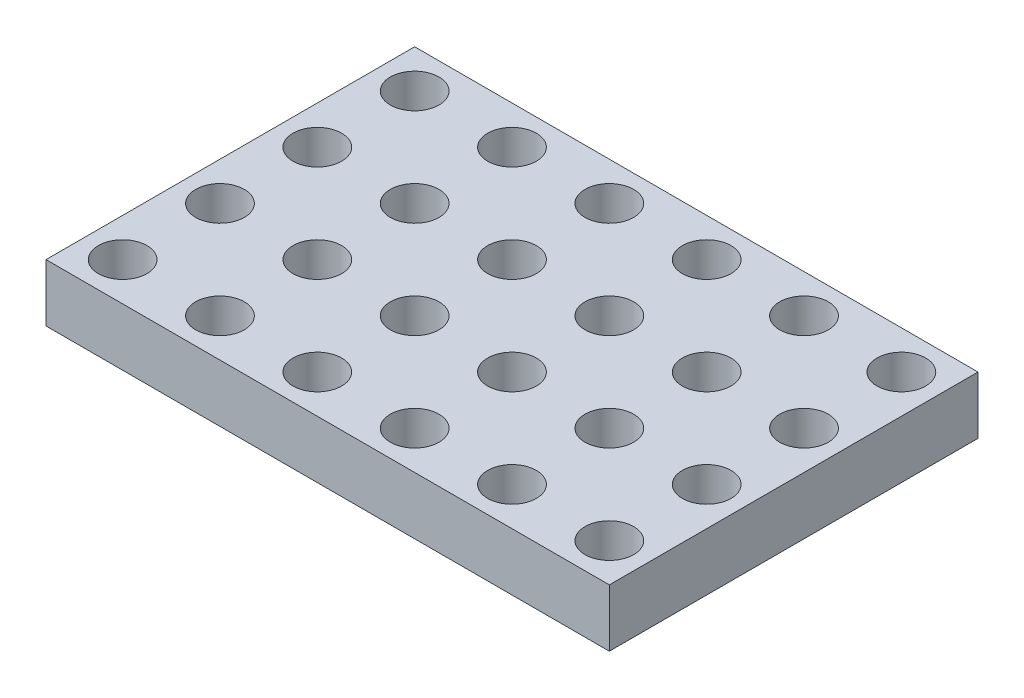
ISO-10303-21;
HEADER;
FILE_DESCRIPTION(('STEP AP214'),'2;1');
FILE_NAME('part.step','',(''),(''),'','','');
FILE_SCHEMA(('AUTOMOTIVE_DESIGN { 1 0 10303 214 1 1 1 1 }'));
ENDSEC;
DATA;
#1=APPLICATION_CONTEXT('core data for automotive mechanical design processes');
#2=APPLICATION_PROTOCOL_DEFINITION('international standard','automotive_design',2000,#1);
#3=PRODUCT_CONTEXT('',#1,'mechanical');
#4=PRODUCT('Part','Part','',(#3));
#5=PRODUCT_RELATED_PRODUCT_CATEGORY('part','',(#4));
#6=PRODUCT_DEFINITION_FORMATION('','',#4);
#7=PRODUCT_DEFINITION_CONTEXT('part definition',#1,'design');
#8=PRODUCT_DEFINITION('design','',#6,#7);
#9=PRODUCT_DEFINITION_SHAPE('','',#8);
#10=(LENGTH_UNIT() NAMED_UNIT(*) SI_UNIT(.MILLI.,.METRE.));
#11=(NAMED_UNIT(*) PLANE_ANGLE_UNIT() SI_UNIT($,.RADIAN.));
#12=(NAMED_UNIT(*) SI_UNIT($,.STERADIAN.) SOLID_ANGLE_UNIT());
#13=UNCERTAINTY_MEASURE_WITH_UNIT(LENGTH_MEASURE(1.E-05),#10,'distance_accuracy_value','');
#14=(GEOMETRIC_REPRESENTATION_CONTEXT(3) GLOBAL_UNCERTAINTY_ASSIGNED_CONTEXT((#13)) GLOBAL_UNIT_ASSIGNED_CONTEXT((#10,
#11,#12)) REPRESENTATION_CONTEXT('',''));
#15=CARTESIAN_POINT('',(0.,0.,0.));
#16=DIRECTION('',(0.,0.,1.));
#17=DIRECTION('',(1.,0.,0.));
#18=AXIS2_PLACEMENT_3D('',#15,#16,#17);
#19=CARTESIAN_POINT('',(0.,1.5,0.));
#20=DIRECTION('',(0.,1.,0.));
#21=DIRECTION('',(0.,0.,1.));
#22=AXIS2_PLACEMENT_3D('',#19,#20,#21);
#23=PLANE('',#22);
#24=CARTESIAN_POINT('',(3.81000000000008,1.5,3.81));
#25=DIRECTION('',(0.,1.,0.));
#26=DIRECTION('',(0.,0.,1.));
#27=AXIS2_PLACEMENT_3D('',#24,#25,#26);
#28=CIRCLE('',#27,0.635000000000001);
#29=CARTESIAN_POINT('',(3.81000000000008,1.5,4.445));
#30=VERTEX_POINT('',#29);
#31=EDGE_CURVE('E241',#30,#30,#28,.T.);
#32=ORIENTED_EDGE('',*,*,#31,.F.);
#33=EDGE_LOOP('',(#32));
#34=FACE_BOUND('',#33,.T.);
#35=CARTESIAN_POINT('',(-1.26999999999992,1.5,3.81));
#36=DIRECTION('',(0.,1.,0.));
#37=DIRECTION('',(0.,0.,1.));
#38=AXIS2_PLACEMENT_3D('',#35,#36,#37);
#39=CIRCLE('',#38,0.635);
#40=CARTESIAN_POINT('',(-1.26999999999992,1.5,4.445));
#41=VERTEX_POINT('',#40);
#42=EDGE_CURVE('E229',#41,#41,#39,.T.);
#43=ORIENTED_EDGE('',*,*,#42,.F.);
#44=EDGE_LOOP('',(#43));
#45=FACE_BOUND('',#44,.T.);
#46=CARTESIAN_POINT('',(-6.34999999999992,1.5,3.81));
#47=DIRECTION('',(0.,1.,0.));
#48=DIRECTION('',(0.,0.,1.));
#49=AXIS2_PLACEMENT_3D('',#46,#47,#48);
#50=CIRCLE('',#49,0.635000000000001);
#51=CARTESIAN_POINT('',(-6.34999999999992,1.5,4.445));
#52=VERTEX_POINT('',#51);
#53=EDGE_CURVE('E217',#52,#52,#50,.T.);
#54=ORIENTED_EDGE('',*,*,#53,.F.);
#55=EDGE_LOOP('',(#54));
#56=FACE_BOUND('',#55,.T.);
#57=CARTESIAN_POINT('',(3.81000000000005,1.5,1.27));
#58=DIRECTION('',(0.,1.,0.));
#59=DIRECTION('',(0.,0.,1.));
#60=AXIS2_PLACEMENT_3D('',#57,#58,#59);
#61=CIRCLE('',#60,0.635000000000001);
#62=CARTESIAN_POINT('',(3.81000000000005,1.5,1.905));
#63=VERTEX_POINT('',#62);
#64=EDGE_CURVE('E205',#63,#63,#61,.T.);
#65=ORIENTED_EDGE('',*,*,#64,.F.);
#66=EDGE_LOOP('',(#65));
#67=FACE_BOUND('',#66,.T.);
#68=CARTESIAN_POINT('',(-1.26999999999995,1.5,1.27));
#69=DIRECTION('',(0.,1.,0.));
#70=DIRECTION('',(0.,0.,1.));
#71=AXIS2_PLACEMENT_3D('',#68,#69,#70);
#72=CIRCLE('',#71,0.635);
#73=CARTESIAN_POINT('',(-1.26999999999995,1.5,1.905));
#74=VERTEX_POINT('',#73);
#75=EDGE_CURVE('E193',#74,#74,#72,.T.);
#76=ORIENTED_EDGE('',*,*,#75,.F.);
#77=EDGE_LOOP('',(#76));
#78=FACE_BOUND('',#77,.T.);
#79=CARTESIAN_POINT('',(-6.34999999999995,1.5,1.27));
#80=DIRECTION('',(0.,1.,0.));
#81=DIRECTION('',(0.,0.,1.));
#82=AXIS2_PLACEMENT_3D('',#79,#80,#81);
#83=CIRCLE('',#82,0.635);
#84=CARTESIAN_POINT('',(-6.34999999999995,1.5,1.905));
#85=VERTEX_POINT('',#84);
#86=EDGE_CURVE('E181',#85,#85,#83,.T.);
#87=ORIENTED_EDGE('',*,*,#86,.F.);
#88=EDGE_LOOP('',(#87));
#89=FACE_BOUND('',#88,.T.);
#90=CARTESIAN_POINT('',(3.81000000000003,1.5,-1.27));
#91=DIRECTION('',(0.,1.,0.));
#92=DIRECTION('',(0.,0.,1.));
#93=AXIS2_PLACEMENT_3D('',#90,#91,#92);
#94=CIRCLE('',#93,0.635000000000001);
#95=CARTESIAN_POINT('',(3.81000000000003,1.5,-0.634999999999996));
#96=VERTEX_POINT('',#95);
#97=EDGE_CURVE('E169',#96,#96,#94,.T.);
#98=ORIENTED_EDGE('',*,*,#97,.F.);
#99=EDGE_LOOP('',(#98));
#100=FACE_BOUND('',#99,.T.);
#101=CARTESIAN_POINT('',(-1.26999999999997,1.5,-1.27));
#102=DIRECTION('',(0.,1.,0.));
#103=DIRECTION('',(0.,0.,1.));
#104=AXIS2_PLACEMENT_3D('',#101,#102,#103);
#105=CIRCLE('',#104,0.635);
#106=CARTESIAN_POINT('',(-1.26999999999997,1.5,-0.634999999999996));
#107=VERTEX_POINT('',#106);
#108=EDGE_CURVE('E157',#107,#107,#105,.T.);
#109=ORIENTED_EDGE('',*,*,#108,.F.);
#110=EDGE_LOOP('',(#109));
#111=FACE_BOUND('',#110,.T.);
#112=CARTESIAN_POINT('',(-6.34999999999997,1.5,-1.27));
#113=DIRECTION('',(0.,1.,0.));
#114=DIRECTION('',(0.,0.,1.));
#115=AXIS2_PLACEMENT_3D('',#112,#113,#114);
#116=CIRCLE('',#115,0.635);
#117=CARTESIAN_POINT('',(-6.34999999999997,1.5,-0.634999999999997));
#118=VERTEX_POINT('',#117);
#119=EDGE_CURVE('E145',#118,#118,#116,.T.);
#120=ORIENTED_EDGE('',*,*,#119,.F.);
#121=EDGE_LOOP('',(#120));
#122=FACE_BOUND('',#121,.T.);
#123=CARTESIAN_POINT('',(3.81,1.5,-3.81));
#124=DIRECTION('',(0.,1.,0.));
#125=DIRECTION('',(0.,0.,1.));
#126=AXIS2_PLACEMENT_3D('',#123,#124,#125);
#127=CIRCLE('',#126,0.635000000000001);
#128=CARTESIAN_POINT('',(3.81,1.5,-3.175));
#129=VERTEX_POINT('',#128);
#130=EDGE_CURVE('E133',#129,#129,#127,.T.);
#131=ORIENTED_EDGE('',*,*,#130,.F.);
#132=EDGE_LOOP('',(#131));
#133=FACE_BOUND('',#132,.T.);
#134=CARTESIAN_POINT('',(-1.27,1.5,-3.81));
#135=DIRECTION('',(0.,1.,0.));
#136=DIRECTION('',(0.,0.,1.));
#137=AXIS2_PLACEMENT_3D('',#134,#135,#136);
#138=CIRCLE('',#137,0.635);
#139=CARTESIAN_POINT('',(-1.27,1.5,-3.175));
#140=VERTEX_POINT('',#139);
#141=EDGE_CURVE('E121',#140,#140,#138,.T.);
#142=ORIENTED_EDGE('',*,*,#141,.F.);
#143=EDGE_LOOP('',(#142));
#144=FACE_BOUND('',#143,.T.);
#145=CARTESIAN_POINT('',(-6.35,1.5,-3.81));
#146=DIRECTION('',(0.,1.,0.));
#147=DIRECTION('',(0.,0.,1.));
#148=AXIS2_PLACEMENT_3D('',#145,#146,#147);
#149=CIRCLE('',#148,0.635000000000001);
#150=CARTESIAN_POINT('',(-6.35,1.5,-3.175));
#151=VERTEX_POINT('',#150);
#152=EDGE_CURVE('E100',#151,#151,#149,.T.);
#153=ORIENTED_EDGE('',*,*,#152,.F.);
#154=EDGE_LOOP('',(#153));
#155=FACE_BOUND('',#154,.T.);
#156=DIRECTION('',(0.,0.,1.));
#157=VECTOR('',#156,1.);
#158=CARTESIAN_POINT('',(-7.35,1.5,4.81));
#159=LINE('',#158,#157);
#160=CARTESIAN_POINT('',(-7.35,1.5,-4.81));
#161=VERTEX_POINT('',#160);
#162=CARTESIAN_POINT('',(-7.35,1.5,4.81));
#163=VERTEX_POINT('',#162);
#164=EDGE_CURVE('E85',#161,#163,#159,.T.);
#165=ORIENTED_EDGE('',*,*,#164,.T.);
#166=DIRECTION('',(1.,0.,0.));
#167=VECTOR('',#166,1.);
#168=CARTESIAN_POINT('',(7.35,1.5,4.81));
#169=LINE('',#168,#167);
#170=CARTESIAN_POINT('',(7.35,1.5,4.81));
#171=VERTEX_POINT('',#170);
#172=EDGE_CURVE('E80',#163,#171,#169,.T.);
#173=ORIENTED_EDGE('',*,*,#172,.T.);
#174=DIRECTION('',(0.,0.,-1.));
#175=VECTOR('',#174,1.);
#176=CARTESIAN_POINT('',(7.35,1.5,4.81));
#177=LINE('',#176,#175);
#178=CARTESIAN_POINT('',(7.35,1.5,-4.81));
#179=VERTEX_POINT('',#178);
#180=EDGE_CURVE('E83',#171,#179,#177,.T.);
#181=ORIENTED_EDGE('',*,*,#180,.T.);
#182=DIRECTION('',(-1.,0.,0.));
#183=VECTOR('',#182,1.);
#184=CARTESIAN_POINT('',(7.35,1.5,-4.81));
#185=LINE('',#184,#183);
#186=EDGE_CURVE('E50',#179,#161,#185,.T.);
#187=ORIENTED_EDGE('',*,*,#186,.T.);
#188=EDGE_LOOP('',(#165,#173,#181,#187));
#189=FACE_BOUND('',#188,.T.);
#190=CARTESIAN_POINT('',(-3.81,1.5,-3.81));
#191=DIRECTION('',(0.,1.,0.));
#192=DIRECTION('',(0.,0.,1.));
#193=AXIS2_PLACEMENT_3D('',#190,#191,#192);
#194=CIRCLE('',#193,0.635);
#195=CARTESIAN_POINT('',(-3.81,1.5,-3.175));
#196=VERTEX_POINT('',#195);
#197=EDGE_CURVE('E115',#196,#196,#194,.T.);
#198=ORIENTED_EDGE('',*,*,#197,.F.);
#199=EDGE_LOOP('',(#198));
#200=FACE_BOUND('',#199,.T.);
#201=CARTESIAN_POINT('',(1.27,1.5,-3.81));
#202=DIRECTION('',(0.,1.,0.));
#203=DIRECTION('',(0.,0.,1.));
#204=AXIS2_PLACEMENT_3D('',#201,#202,#203);
#205=CIRCLE('',#204,0.635);
#206=CARTESIAN_POINT('',(1.27,1.5,-3.175));
#207=VERTEX_POINT('',#206);
#208=EDGE_CURVE('E127',#207,#207,#205,.T.);
#209=ORIENTED_EDGE('',*,*,#208,.F.);
#210=EDGE_LOOP('',(#209));
#211=FACE_BOUND('',#210,.T.);
#212=CARTESIAN_POINT('',(6.35,1.5,-3.81));
#213=DIRECTION('',(0.,1.,0.));
#214=DIRECTION('',(0.,0.,1.));
#215=AXIS2_PLACEMENT_3D('',#212,#213,#214);
#216=CIRCLE('',#215,0.635000000000001);
#217=CARTESIAN_POINT('',(6.35,1.5,-3.175));
#218=VERTEX_POINT('',#217);
#219=EDGE_CURVE('E139',#218,#218,#216,.T.);
#220=ORIENTED_EDGE('',*,*,#219,.F.);
#221=EDGE_LOOP('',(#220));
#222=FACE_BOUND('',#221,.T.);
#223=CARTESIAN_POINT('',(-3.80999999999997,1.5,-1.27));
#224=DIRECTION('',(0.,1.,0.));
#225=DIRECTION('',(0.,0.,1.));
#226=AXIS2_PLACEMENT_3D('',#223,#224,#225);
#227=CIRCLE('',#226,0.635);
#228=CARTESIAN_POINT('',(-3.80999999999997,1.5,-0.634999999999996));
#229=VERTEX_POINT('',#228);
#230=EDGE_CURVE('E151',#229,#229,#227,.T.);
#231=ORIENTED_EDGE('',*,*,#230,.F.);
#232=EDGE_LOOP('',(#231));
#233=FACE_BOUND('',#232,.T.);
#234=CARTESIAN_POINT('',(1.27000000000003,1.5,-1.27));
#235=DIRECTION('',(0.,1.,0.));
#236=DIRECTION('',(0.,0.,1.));
#237=AXIS2_PLACEMENT_3D('',#234,#235,#236);
#238=CIRCLE('',#237,0.635);
#239=CARTESIAN_POINT('',(1.27000000000003,1.5,-0.634999999999996));
#240=VERTEX_POINT('',#239);
#241=EDGE_CURVE('E163',#240,#240,#238,.T.);
#242=ORIENTED_EDGE('',*,*,#241,.F.);
#243=EDGE_LOOP('',(#242));
#244=FACE_BOUND('',#243,.T.);
#245=CARTESIAN_POINT('',(6.35000000000003,1.5,-1.27));
#246=DIRECTION('',(0.,1.,0.));
#247=DIRECTION('',(0.,0.,1.));
#248=AXIS2_PLACEMENT_3D('',#245,#246,#247);
#249=CIRCLE('',#248,0.635000000000001);
#250=CARTESIAN_POINT('',(6.35000000000003,1.5,-0.634999999999996));
#251=VERTEX_POINT('',#250);
#252=EDGE_CURVE('E175',#251,#251,#249,.T.);
#253=ORIENTED_EDGE('',*,*,#252,.F.);
#254=EDGE_LOOP('',(#253));
#255=FACE_BOUND('',#254,.T.);
#256=CARTESIAN_POINT('',(-3.80999999999995,1.5,1.27));
#257=DIRECTION('',(0.,1.,0.));
#258=DIRECTION('',(0.,0.,1.));
#259=AXIS2_PLACEMENT_3D('',#256,#257,#258);
#260=CIRCLE('',#259,0.635);
#261=CARTESIAN_POINT('',(-3.80999999999995,1.5,1.905));
#262=VERTEX_POINT('',#261);
#263=EDGE_CURVE('E187',#262,#262,#260,.T.);
#264=ORIENTED_EDGE('',*,*,#263,.F.);
#265=EDGE_LOOP('',(#264));
#266=FACE_BOUND('',#265,.T.);
#267=CARTESIAN_POINT('',(1.27000000000005,1.5,1.27));
#268=DIRECTION('',(0.,1.,0.));
#269=DIRECTION('',(0.,0.,1.));
#270=AXIS2_PLACEMENT_3D('',#267,#268,#269);
#271=CIRCLE('',#270,0.635);
#272=CARTESIAN_POINT('',(1.27000000000005,1.5,1.905));
#273=VERTEX_POINT('',#272);
#274=EDGE_CURVE('E199',#273,#273,#271,.T.);
#275=ORIENTED_EDGE('',*,*,#274,.F.);
#276=EDGE_LOOP('',(#275));
#277=FACE_BOUND('',#276,.T.);
#278=CARTESIAN_POINT('',(6.35000000000006,1.5,1.27));
#279=DIRECTION('',(0.,1.,0.));
#280=DIRECTION('',(0.,0.,1.));
#281=AXIS2_PLACEMENT_3D('',#278,#279,#280);
#282=CIRCLE('',#281,0.635000000000001);
#283=CARTESIAN_POINT('',(6.35000000000006,1.5,1.905));
#284=VERTEX_POINT('',#283);
#285=EDGE_CURVE('E211',#284,#284,#282,.T.);
#286=ORIENTED_EDGE('',*,*,#285,.F.);
#287=EDGE_LOOP('',(#286));
#288=FACE_BOUND('',#287,.T.);
#289=CARTESIAN_POINT('',(-3.80999999999992,1.5,3.81));
#290=DIRECTION('',(0.,1.,0.));
#291=DIRECTION('',(0.,0.,1.));
#292=AXIS2_PLACEMENT_3D('',#289,#290,#291);
#293=CIRCLE('',#292,0.635);
#294=CARTESIAN_POINT('',(-3.80999999999992,1.5,4.445));
#295=VERTEX_POINT('',#294);
#296=EDGE_CURVE('E223',#295,#295,#293,.T.);
#297=ORIENTED_EDGE('',*,*,#296,.F.);
#298=EDGE_LOOP('',(#297));
#299=FACE_BOUND('',#298,.T.);
#300=CARTESIAN_POINT('',(1.27000000000008,1.5,3.81));
#301=DIRECTION('',(0.,1.,0.));
#302=DIRECTION('',(0.,0.,1.));
#303=AXIS2_PLACEMENT_3D('',#300,#301,#302);
#304=CIRCLE('',#303,0.635);
#305=CARTESIAN_POINT('',(1.27000000000008,1.5,4.445));
#306=VERTEX_POINT('',#305);
#307=EDGE_CURVE('E235',#306,#306,#304,.T.);
#308=ORIENTED_EDGE('',*,*,#307,.F.);
#309=EDGE_LOOP('',(#308));
#310=FACE_BOUND('',#309,.T.);
#311=CARTESIAN_POINT('',(6.35000000000008,1.5,3.81));
#312=DIRECTION('',(0.,1.,0.));
#313=DIRECTION('',(0.,0.,1.));
#314=AXIS2_PLACEMENT_3D('',#311,#312,#313);
#315=CIRCLE('',#314,0.635000000000001);
#316=CARTESIAN_POINT('',(6.35000000000008,1.5,4.445));
#317=VERTEX_POINT('',#316);
#318=EDGE_CURVE('E247',#317,#317,#315,.T.);
#319=ORIENTED_EDGE('',*,*,#318,.F.);
#320=EDGE_LOOP('',(#319));
#321=FACE_BOUND('',#320,.T.);
#322=ADVANCED_FACE('F33',(#34,#45,#56,#67,#78,#89,#100,#111,#122,#133,#144,#155,#189,#200,#211,
#222,#233,#244,#255,#266,#277,#288,#299,#310,#321),#23,.T.);
#323=CARTESIAN_POINT('',(0.,0.,0.));
#324=DIRECTION('',(0.,1.,0.));
#325=DIRECTION('',(0.,0.,1.));
#326=AXIS2_PLACEMENT_3D('',#323,#324,#325);
#327=PLANE('',#326);
#328=CARTESIAN_POINT('',(3.81000000000008,0.,3.81));
#329=DIRECTION('',(0.,1.,0.));
#330=DIRECTION('',(0.,0.,1.));
#331=AXIS2_PLACEMENT_3D('',#328,#329,#330);
#332=CIRCLE('',#331,0.635000000000001);
#333=CARTESIAN_POINT('',(3.81000000000008,0.,4.445));
#334=VERTEX_POINT('',#333);
#335=EDGE_CURVE('E244',#334,#334,#332,.T.);
#336=ORIENTED_EDGE('',*,*,#335,.T.);
#337=EDGE_LOOP('',(#336));
#338=FACE_BOUND('',#337,.T.);
#339=CARTESIAN_POINT('',(-1.26999999999992,0.,3.81));
#340=DIRECTION('',(0.,1.,0.));
#341=DIRECTION('',(0.,0.,1.));
#342=AXIS2_PLACEMENT_3D('',#339,#340,#341);
#343=CIRCLE('',#342,0.635);
#344=CARTESIAN_POINT('',(-1.26999999999992,0.,4.445));
#345=VERTEX_POINT('',#344);
#346=EDGE_CURVE('E232',#345,#345,#343,.T.);
#347=ORIENTED_EDGE('',*,*,#346,.T.);
#348=EDGE_LOOP('',(#347));
#349=FACE_BOUND('',#348,.T.);
#350=CARTESIAN_POINT('',(-6.34999999999992,0.,3.81));
#351=DIRECTION('',(0.,1.,0.));
#352=DIRECTION('',(0.,0.,1.));
#353=AXIS2_PLACEMENT_3D('',#350,#351,#352);
#354=CIRCLE('',#353,0.635000000000001);
#355=CARTESIAN_POINT('',(-6.34999999999992,0.,4.445));
#356=VERTEX_POINT('',#355);
#357=EDGE_CURVE('E220',#356,#356,#354,.T.);
#358=ORIENTED_EDGE('',*,*,#357,.T.);
#359=EDGE_LOOP('',(#358));
#360=FACE_BOUND('',#359,.T.);
#361=CARTESIAN_POINT('',(3.81000000000005,0.,1.27));
#362=DIRECTION('',(0.,1.,0.));
#363=DIRECTION('',(0.,0.,1.));
#364=AXIS2_PLACEMENT_3D('',#361,#362,#363);
#365=CIRCLE('',#364,0.635000000000001);
#366=CARTESIAN_POINT('',(3.81000000000005,0.,1.905));
#367=VERTEX_POINT('',#366);
#368=EDGE_CURVE('E208',#367,#367,#365,.T.);
#369=ORIENTED_EDGE('',*,*,#368,.T.);
#370=EDGE_LOOP('',(#369));
#371=FACE_BOUND('',#370,.T.);
#372=CARTESIAN_POINT('',(-1.26999999999995,0.,1.27));
#373=DIRECTION('',(0.,1.,0.));
#374=DIRECTION('',(0.,0.,1.));
#375=AXIS2_PLACEMENT_3D('',#372,#373,#374);
#376=CIRCLE('',#375,0.635);
#377=CARTESIAN_POINT('',(-1.26999999999995,0.,1.905));
#378=VERTEX_POINT('',#377);
#379=EDGE_CURVE('E196',#378,#378,#376,.T.);
#380=ORIENTED_EDGE('',*,*,#379,.T.);
#381=EDGE_LOOP('',(#380));
#382=FACE_BOUND('',#381,.T.);
#383=CARTESIAN_POINT('',(-6.34999999999995,0.,1.27));
#384=DIRECTION('',(0.,1.,0.));
#385=DIRECTION('',(0.,0.,1.));
#386=AXIS2_PLACEMENT_3D('',#383,#384,#385);
#387=CIRCLE('',#386,0.635);
#388=CARTESIAN_POINT('',(-6.34999999999995,0.,1.905));
#389=VERTEX_POINT('',#388);
#390=EDGE_CURVE('E184',#389,#389,#387,.T.);
#391=ORIENTED_EDGE('',*,*,#390,.T.);
#392=EDGE_LOOP('',(#391));
#393=FACE_BOUND('',#392,.T.);
#394=CARTESIAN_POINT('',(3.81000000000003,0.,-1.27));
#395=DIRECTION('',(0.,1.,0.));
#396=DIRECTION('',(0.,0.,1.));
#397=AXIS2_PLACEMENT_3D('',#394,#395,#396);
#398=CIRCLE('',#397,0.635000000000001);
#399=CARTESIAN_POINT('',(3.81000000000003,0.,-0.634999999999996));
#400=VERTEX_POINT('',#399);
#401=EDGE_CURVE('E172',#400,#400,#398,.T.);
#402=ORIENTED_EDGE('',*,*,#401,.T.);
#403=EDGE_LOOP('',(#402));
#404=FACE_BOUND('',#403,.T.);
#405=CARTESIAN_POINT('',(-1.26999999999997,0.,-1.27));
#406=DIRECTION('',(0.,1.,0.));
#407=DIRECTION('',(0.,0.,1.));
#408=AXIS2_PLACEMENT_3D('',#405,#406,#407);
#409=CIRCLE('',#408,0.635);
#410=CARTESIAN_POINT('',(-1.26999999999997,0.,-0.634999999999996));
#411=VERTEX_POINT('',#410);
#412=EDGE_CURVE('E160',#411,#411,#409,.T.);
#413=ORIENTED_EDGE('',*,*,#412,.T.);
#414=EDGE_LOOP('',(#413));
#415=FACE_BOUND('',#414,.T.);
#416=CARTESIAN_POINT('',(-6.34999999999997,0.,-1.27));
#417=DIRECTION('',(0.,1.,0.));
#418=DIRECTION('',(0.,0.,1.));
#419=AXIS2_PLACEMENT_3D('',#416,#417,#418);
#420=CIRCLE('',#419,0.635);
#421=CARTESIAN_POINT('',(-6.34999999999997,0.,-0.634999999999997));
#422=VERTEX_POINT('',#421);
#423=EDGE_CURVE('E148',#422,#422,#420,.T.);
#424=ORIENTED_EDGE('',*,*,#423,.T.);
#425=EDGE_LOOP('',(#424));
#426=FACE_BOUND('',#425,.T.);
#427=CARTESIAN_POINT('',(3.81,0.,-3.81));
#428=DIRECTION('',(0.,1.,0.));
#429=DIRECTION('',(0.,0.,1.));
#430=AXIS2_PLACEMENT_3D('',#427,#428,#429);
#431=CIRCLE('',#430,0.635000000000001);
#432=CARTESIAN_POINT('',(3.81,0.,-3.175));
#433=VERTEX_POINT('',#432);
#434=EDGE_CURVE('E136',#433,#433,#431,.T.);
#435=ORIENTED_EDGE('',*,*,#434,.T.);
#436=EDGE_LOOP('',(#435));
#437=FACE_BOUND('',#436,.T.);
#438=CARTESIAN_POINT('',(-1.27,0.,-3.81));
#439=DIRECTION('',(0.,1.,0.));
#440=DIRECTION('',(0.,0.,1.));
#441=AXIS2_PLACEMENT_3D('',#438,#439,#440);
#442=CIRCLE('',#441,0.635);
#443=CARTESIAN_POINT('',(-1.27,0.,-3.175));
#444=VERTEX_POINT('',#443);
#445=EDGE_CURVE('E124',#444,#444,#442,.T.);
#446=ORIENTED_EDGE('',*,*,#445,.T.);
#447=EDGE_LOOP('',(#446));
#448=FACE_BOUND('',#447,.T.);
#449=CARTESIAN_POINT('',(-6.35,0.,-3.81));
#450=DIRECTION('',(0.,1.,0.));
#451=DIRECTION('',(0.,0.,1.));
#452=AXIS2_PLACEMENT_3D('',#449,#450,#451);
#453=CIRCLE('',#452,0.635000000000001);
#454=CARTESIAN_POINT('',(-6.35,0.,-3.175));
#455=VERTEX_POINT('',#454);
#456=EDGE_CURVE('E112',#455,#455,#453,.T.);
#457=ORIENTED_EDGE('',*,*,#456,.T.);
#458=EDGE_LOOP('',(#457));
#459=FACE_BOUND('',#458,.T.);
#460=DIRECTION('',(0.,0.,1.));
#461=VECTOR('',#460,1.);
#462=CARTESIAN_POINT('',(-7.35,0.,4.81));
#463=LINE('',#462,#461);
#464=CARTESIAN_POINT('',(-7.35,0.,-4.81));
#465=VERTEX_POINT('',#464);
#466=CARTESIAN_POINT('',(-7.35,0.,4.81));
#467=VERTEX_POINT('',#466);
#468=EDGE_CURVE('E97',#465,#467,#463,.T.);
#469=ORIENTED_EDGE('',*,*,#468,.F.);
#470=DIRECTION('',(-1.,0.,0.));
#471=VECTOR('',#470,1.);
#472=CARTESIAN_POINT('',(7.35,0.,-4.81));
#473=LINE('',#472,#471);
#474=CARTESIAN_POINT('',(7.35,0.,-4.81));
#475=VERTEX_POINT('',#474);
#476=EDGE_CURVE('E73',#475,#465,#473,.T.);
#477=ORIENTED_EDGE('',*,*,#476,.F.);
#478=DIRECTION('',(0.,0.,-1.));
#479=VECTOR('',#478,1.);
#480=CARTESIAN_POINT('',(7.35,0.,4.81));
#481=LINE('',#480,#479);
#482=CARTESIAN_POINT('',(7.35,0.,4.81));
#483=VERTEX_POINT('',#482);
#484=EDGE_CURVE('E67',#483,#475,#481,.T.);
#485=ORIENTED_EDGE('',*,*,#484,.F.);
#486=DIRECTION('',(1.,0.,0.));
#487=VECTOR('',#486,1.);
#488=CARTESIAN_POINT('',(7.35,0.,4.81));
#489=LINE('',#488,#487);
#490=EDGE_CURVE('E89',#467,#483,#489,.T.);
#491=ORIENTED_EDGE('',*,*,#490,.F.);
#492=EDGE_LOOP('',(#469,#477,#485,#491));
#493=FACE_BOUND('',#492,.T.);
#494=CARTESIAN_POINT('',(-3.81,0.,-3.81));
#495=DIRECTION('',(0.,1.,0.));
#496=DIRECTION('',(0.,0.,1.));
#497=AXIS2_PLACEMENT_3D('',#494,#495,#496);
#498=CIRCLE('',#497,0.635);
#499=CARTESIAN_POINT('',(-3.81,0.,-3.175));
#500=VERTEX_POINT('',#499);
#501=EDGE_CURVE('E118',#500,#500,#498,.T.);
#502=ORIENTED_EDGE('',*,*,#501,.T.);
#503=EDGE_LOOP('',(#502));
#504=FACE_BOUND('',#503,.T.);
#505=CARTESIAN_POINT('',(1.27,0.,-3.81));
#506=DIRECTION('',(0.,1.,0.));
#507=DIRECTION('',(0.,0.,1.));
#508=AXIS2_PLACEMENT_3D('',#505,#506,#507);
#509=CIRCLE('',#508,0.635);
#510=CARTESIAN_POINT('',(1.27,0.,-3.175));
#511=VERTEX_POINT('',#510);
#512=EDGE_CURVE('E130',#511,#511,#509,.T.);
#513=ORIENTED_EDGE('',*,*,#512,.T.);
#514=EDGE_LOOP('',(#513));
#515=FACE_BOUND('',#514,.T.);
#516=CARTESIAN_POINT('',(6.35,0.,-3.81));
#517=DIRECTION('',(0.,1.,0.));
#518=DIRECTION('',(0.,0.,1.));
#519=AXIS2_PLACEMENT_3D('',#516,#517,#518);
#520=CIRCLE('',#519,0.635000000000001);
#521=CARTESIAN_POINT('',(6.35,0.,-3.175));
#522=VERTEX_POINT('',#521);
#523=EDGE_CURVE('E142',#522,#522,#520,.T.);
#524=ORIENTED_EDGE('',*,*,#523,.T.);
#525=EDGE_LOOP('',(#524));
#526=FACE_BOUND('',#525,.T.);
#527=CARTESIAN_POINT('',(-3.80999999999997,0.,-1.27));
#528=DIRECTION('',(0.,1.,0.));
#529=DIRECTION('',(0.,0.,1.));
#530=AXIS2_PLACEMENT_3D('',#527,#528,#529);
#531=CIRCLE('',#530,0.635);
#532=CARTESIAN_POINT('',(-3.80999999999997,0.,-0.634999999999996));
#533=VERTEX_POINT('',#532);
#534=EDGE_CURVE('E154',#533,#533,#531,.T.);
#535=ORIENTED_EDGE('',*,*,#534,.T.);
#536=EDGE_LOOP('',(#535));
#537=FACE_BOUND('',#536,.T.);
#538=CARTESIAN_POINT('',(1.27000000000003,0.,-1.27));
#539=DIRECTION('',(0.,1.,0.));
#540=DIRECTION('',(0.,0.,1.));
#541=AXIS2_PLACEMENT_3D('',#538,#539,#540);
#542=CIRCLE('',#541,0.635);
#543=CARTESIAN_POINT('',(1.27000000000003,0.,-0.634999999999996));
#544=VERTEX_POINT('',#543);
#545=EDGE_CURVE('E166',#544,#544,#542,.T.);
#546=ORIENTED_EDGE('',*,*,#545,.T.);
#547=EDGE_LOOP('',(#546));
#548=FACE_BOUND('',#547,.T.);
#549=CARTESIAN_POINT('',(6.35000000000003,0.,-1.27));
#550=DIRECTION('',(0.,1.,0.));
#551=DIRECTION('',(0.,0.,1.));
#552=AXIS2_PLACEMENT_3D('',#549,#550,#551);
#553=CIRCLE('',#552,0.635000000000001);
#554=CARTESIAN_POINT('',(6.35000000000003,0.,-0.634999999999996));
#555=VERTEX_POINT('',#554);
#556=EDGE_CURVE('E178',#555,#555,#553,.T.);
#557=ORIENTED_EDGE('',*,*,#556,.T.);
#558=EDGE_LOOP('',(#557));
#559=FACE_BOUND('',#558,.T.);
#560=CARTESIAN_POINT('',(-3.80999999999995,0.,1.27));
#561=DIRECTION('',(0.,1.,0.));
#562=DIRECTION('',(0.,0.,1.));
#563=AXIS2_PLACEMENT_3D('',#560,#561,#562);
#564=CIRCLE('',#563,0.635);
#565=CARTESIAN_POINT('',(-3.80999999999995,0.,1.905));
#566=VERTEX_POINT('',#565);
#567=EDGE_CURVE('E190',#566,#566,#564,.T.);
#568=ORIENTED_EDGE('',*,*,#567,.T.);
#569=EDGE_LOOP('',(#568));
#570=FACE_BOUND('',#569,.T.);
#571=CARTESIAN_POINT('',(1.27000000000005,0.,1.27));
#572=DIRECTION('',(0.,1.,0.));
#573=DIRECTION('',(0.,0.,1.));
#574=AXIS2_PLACEMENT_3D('',#571,#572,#573);
#575=CIRCLE('',#574,0.635);
#576=CARTESIAN_POINT('',(1.27000000000005,0.,1.905));
#577=VERTEX_POINT('',#576);
#578=EDGE_CURVE('E202',#577,#577,#575,.T.);
#579=ORIENTED_EDGE('',*,*,#578,.T.);
#580=EDGE_LOOP('',(#579));
#581=FACE_BOUND('',#580,.T.);
#582=CARTESIAN_POINT('',(6.35000000000006,0.,1.27));
#583=DIRECTION('',(0.,1.,0.));
#584=DIRECTION('',(0.,0.,1.));
#585=AXIS2_PLACEMENT_3D('',#582,#583,#584);
#586=CIRCLE('',#585,0.635000000000001);
#587=CARTESIAN_POINT('',(6.35000000000006,0.,1.905));
#588=VERTEX_POINT('',#587);
#589=EDGE_CURVE('E214',#588,#588,#586,.T.);
#590=ORIENTED_EDGE('',*,*,#589,.T.);
#591=EDGE_LOOP('',(#590));
#592=FACE_BOUND('',#591,.T.);
#593=CARTESIAN_POINT('',(-3.80999999999992,0.,3.81));
#594=DIRECTION('',(0.,1.,0.));
#595=DIRECTION('',(0.,0.,1.));
#596=AXIS2_PLACEMENT_3D('',#593,#594,#595);
#597=CIRCLE('',#596,0.635);
#598=CARTESIAN_POINT('',(-3.80999999999992,0.,4.445));
#599=VERTEX_POINT('',#598);
#600=EDGE_CURVE('E226',#599,#599,#597,.T.);
#601=ORIENTED_EDGE('',*,*,#600,.T.);
#602=EDGE_LOOP('',(#601));
#603=FACE_BOUND('',#602,.T.);
#604=CARTESIAN_POINT('',(1.27000000000008,0.,3.81));
#605=DIRECTION('',(0.,1.,0.));
#606=DIRECTION('',(0.,0.,1.));
#607=AXIS2_PLACEMENT_3D('',#604,#605,#606);
#608=CIRCLE('',#607,0.635);
#609=CARTESIAN_POINT('',(1.27000000000008,0.,4.445));
#610=VERTEX_POINT('',#609);
#611=EDGE_CURVE('E238',#610,#610,#608,.T.);
#612=ORIENTED_EDGE('',*,*,#611,.T.);
#613=EDGE_LOOP('',(#612));
#614=FACE_BOUND('',#613,.T.);
#615=CARTESIAN_POINT('',(6.35000000000008,0.,3.81));
#616=DIRECTION('',(0.,1.,0.));
#617=DIRECTION('',(0.,0.,1.));
#618=AXIS2_PLACEMENT_3D('',#615,#616,#617);
#619=CIRCLE('',#618,0.635000000000001);
#620=CARTESIAN_POINT('',(6.35000000000008,0.,4.445));
#621=VERTEX_POINT('',#620);
#622=EDGE_CURVE('E250',#621,#621,#619,.T.);
#623=ORIENTED_EDGE('',*,*,#622,.T.);
#624=EDGE_LOOP('',(#623));
#625=FACE_BOUND('',#624,.T.);
#626=ADVANCED_FACE('F108',(#338,#349,#360,#371,#382,#393,#404,#415,#426,#437,#448,#459,#493,
#504,#515,#526,#537,#548,#559,#570,#581,#592,#603,#614,#625),#327,.F.);
#627=CARTESIAN_POINT('',(-7.35,1.5,4.81));
#628=DIRECTION('',(1.,0.,0.));
#629=DIRECTION('',(0.,0.,-1.));
#630=AXIS2_PLACEMENT_3D('',#627,#628,#629);
#631=PLANE('',#630);
#632=ORIENTED_EDGE('',*,*,#468,.T.);
#633=DIRECTION('',(0.,-1.,0.));
#634=VECTOR('',#633,1.);
#635=CARTESIAN_POINT('',(-7.35,1.5,4.81));
#636=LINE('',#635,#634);
#637=EDGE_CURVE('E11',#163,#467,#636,.T.);
#638=ORIENTED_EDGE('',*,*,#637,.F.);
#639=ORIENTED_EDGE('',*,*,#164,.F.);
#640=DIRECTION('',(0.,-1.,0.));
#641=VECTOR('',#640,1.);
#642=CARTESIAN_POINT('',(-7.35,1.5,-4.81));
#643=LINE('',#642,#641);
#644=EDGE_CURVE('E93',#161,#465,#643,.T.);
#645=ORIENTED_EDGE('',*,*,#644,.T.);
#646=EDGE_LOOP('',(#632,#638,#639,#645));
#647=FACE_BOUND('',#646,.T.);
#648=ADVANCED_FACE('F35',(#647),#631,.F.);
#649=CARTESIAN_POINT('',(7.35,1.5,4.81));
#650=DIRECTION('',(0.,0.,-1.));
#651=DIRECTION('',(-1.,0.,0.));
#652=AXIS2_PLACEMENT_3D('',#649,#650,#651);
#653=PLANE('',#652);
#654=ORIENTED_EDGE('',*,*,#490,.T.);
#655=DIRECTION('',(0.,-1.,0.));
#656=VECTOR('',#655,1.);
#657=CARTESIAN_POINT('',(7.35,1.5,4.81));
#658=LINE('',#657,#656);
#659=EDGE_CURVE('E42',#171,#483,#658,.T.);
#660=ORIENTED_EDGE('',*,*,#659,.F.);
#661=ORIENTED_EDGE('',*,*,#172,.F.);
#662=ORIENTED_EDGE('',*,*,#637,.T.);
#663=EDGE_LOOP('',(#654,#660,#661,#662));
#664=FACE_BOUND('',#663,.T.);
#665=ADVANCED_FACE('F88',(#664),#653,.F.);
#666=CARTESIAN_POINT('',(7.35,1.5,4.81));
#667=DIRECTION('',(-1.,0.,0.));
#668=DIRECTION('',(0.,0.,1.));
#669=AXIS2_PLACEMENT_3D('',#666,#667,#668);
#670=PLANE('',#669);
#671=ORIENTED_EDGE('',*,*,#484,.T.);
#672=DIRECTION('',(0.,-1.,0.));
#673=VECTOR('',#672,1.);
#674=CARTESIAN_POINT('',(7.35,1.5,-4.81));
#675=LINE('',#674,#673);
#676=EDGE_CURVE('E90',#179,#475,#675,.T.);
#677=ORIENTED_EDGE('',*,*,#676,.F.);
#678=ORIENTED_EDGE('',*,*,#180,.F.);
#679=ORIENTED_EDGE('',*,*,#659,.T.);
#680=EDGE_LOOP('',(#671,#677,#678,#679));
#681=FACE_BOUND('',#680,.T.);
#682=ADVANCED_FACE('F91',(#681),#670,.F.);
#683=CARTESIAN_POINT('',(7.35,1.5,-4.81));
#684=DIRECTION('',(0.,0.,1.));
#685=DIRECTION('',(1.,0.,0.));
#686=AXIS2_PLACEMENT_3D('',#683,#684,#685);
#687=PLANE('',#686);
#688=ORIENTED_EDGE('',*,*,#476,.T.);
#689=ORIENTED_EDGE('',*,*,#644,.F.);
#690=ORIENTED_EDGE('',*,*,#186,.F.);
#691=ORIENTED_EDGE('',*,*,#676,.T.);
#692=EDGE_LOOP('',(#688,#689,#690,#691));
#693=FACE_BOUND('',#692,.T.);
#694=ADVANCED_FACE('F105',(#693),#687,.F.);
#695=CARTESIAN_POINT('',(-6.35,1.5,-3.81));
#696=DIRECTION('',(0.,-1.,0.));
#697=DIRECTION('',(0.,0.,-1.));
#698=AXIS2_PLACEMENT_3D('',#695,#696,#697);
#699=CYLINDRICAL_SURFACE('',#698,0.635000000000001);
#700=ORIENTED_EDGE('',*,*,#152,.T.);
#701=EDGE_LOOP('',(#700));
#702=FACE_BOUND('',#701,.T.);
#703=ORIENTED_EDGE('',*,*,#456,.F.);
#704=EDGE_LOOP('',(#703));
#705=FACE_BOUND('',#704,.T.);
#706=ADVANCED_FACE('F270',(#702,#705),#699,.F.);
#707=CARTESIAN_POINT('',(-3.81,1.5,-3.81));
#708=DIRECTION('',(0.,-1.,0.));
#709=DIRECTION('',(0.,0.,-1.));
#710=AXIS2_PLACEMENT_3D('',#707,#708,#709);
#711=CYLINDRICAL_SURFACE('',#710,0.635);
#712=ORIENTED_EDGE('',*,*,#197,.T.);
#713=EDGE_LOOP('',(#712));
#714=FACE_BOUND('',#713,.T.);
#715=ORIENTED_EDGE('',*,*,#501,.F.);
#716=EDGE_LOOP('',(#715));
#717=FACE_BOUND('',#716,.T.);
#718=ADVANCED_FACE('F316',(#714,#717),#711,.F.);
#719=CARTESIAN_POINT('',(-1.27,1.5,-3.81));
#720=DIRECTION('',(0.,-1.,0.));
#721=DIRECTION('',(0.,0.,-1.));
#722=AXIS2_PLACEMENT_3D('',#719,#720,#721);
#723=CYLINDRICAL_SURFACE('',#722,0.635);
#724=ORIENTED_EDGE('',*,*,#141,.T.);
#725=EDGE_LOOP('',(#724));
#726=FACE_BOUND('',#725,.T.);
#727=ORIENTED_EDGE('',*,*,#445,.F.);
#728=EDGE_LOOP('',(#727));
#729=FACE_BOUND('',#728,.T.);
#730=ADVANCED_FACE('F324',(#726,#729),#723,.F.);
#731=CARTESIAN_POINT('',(1.27,1.5,-3.81));
#732=DIRECTION('',(0.,-1.,0.));
#733=DIRECTION('',(0.,0.,-1.));
#734=AXIS2_PLACEMENT_3D('',#731,#732,#733);
#735=CYLINDRICAL_SURFACE('',#734,0.635);
#736=ORIENTED_EDGE('',*,*,#208,.T.);
#737=EDGE_LOOP('',(#736));
#738=FACE_BOUND('',#737,.T.);
#739=ORIENTED_EDGE('',*,*,#512,.F.);
#740=EDGE_LOOP('',(#739));
#741=FACE_BOUND('',#740,.T.);
#742=ADVANCED_FACE('F332',(#738,#741),#735,.F.);
#743=CARTESIAN_POINT('',(3.81,1.5,-3.81));
#744=DIRECTION('',(0.,-1.,0.));
#745=DIRECTION('',(0.,0.,-1.));
#746=AXIS2_PLACEMENT_3D('',#743,#744,#745);
#747=CYLINDRICAL_SURFACE('',#746,0.635000000000001);
#748=ORIENTED_EDGE('',*,*,#130,.T.);
#749=EDGE_LOOP('',(#748));
#750=FACE_BOUND('',#749,.T.);
#751=ORIENTED_EDGE('',*,*,#434,.F.);
#752=EDGE_LOOP('',(#751));
#753=FACE_BOUND('',#752,.T.);
#754=ADVANCED_FACE('F341',(#750,#753),#747,.F.);
#755=CARTESIAN_POINT('',(6.35,1.5,-3.81));
#756=DIRECTION('',(0.,-1.,0.));
#757=DIRECTION('',(0.,0.,-1.));
#758=AXIS2_PLACEMENT_3D('',#755,#756,#757);
#759=CYLINDRICAL_SURFACE('',#758,0.635000000000001);
#760=ORIENTED_EDGE('',*,*,#219,.T.);
#761=EDGE_LOOP('',(#760));
#762=FACE_BOUND('',#761,.T.);
#763=ORIENTED_EDGE('',*,*,#523,.F.);
#764=EDGE_LOOP('',(#763));
#765=FACE_BOUND('',#764,.T.);
#766=ADVANCED_FACE('F350',(#762,#765),#759,.F.);
#767=CARTESIAN_POINT('',(-6.34999999999997,1.5,-1.27));
#768=DIRECTION('',(0.,-1.,0.));
#769=DIRECTION('',(0.,0.,-1.));
#770=AXIS2_PLACEMENT_3D('',#767,#768,#769);
#771=CYLINDRICAL_SURFACE('',#770,0.635);
#772=ORIENTED_EDGE('',*,*,#119,.T.);
#773=EDGE_LOOP('',(#772));
#774=FACE_BOUND('',#773,.T.);
#775=ORIENTED_EDGE('',*,*,#423,.F.);
#776=EDGE_LOOP('',(#775));
#777=FACE_BOUND('',#776,.T.);
#778=ADVANCED_FACE('F359',(#774,#777),#771,.F.);
#779=CARTESIAN_POINT('',(-3.80999999999997,1.5,-1.27));
#780=DIRECTION('',(0.,-1.,0.));
#781=DIRECTION('',(0.,0.,-1.));
#782=AXIS2_PLACEMENT_3D('',#779,#780,#781);
#783=CYLINDRICAL_SURFACE('',#782,0.635);
#784=ORIENTED_EDGE('',*,*,#230,.T.);
#785=EDGE_LOOP('',(#784));
#786=FACE_BOUND('',#785,.T.);
#787=ORIENTED_EDGE('',*,*,#534,.F.);
#788=EDGE_LOOP('',(#787));
#789=FACE_BOUND('',#788,.T.);
#790=ADVANCED_FACE('F368',(#786,#789),#783,.F.);
#791=CARTESIAN_POINT('',(-1.26999999999997,1.5,-1.27));
#792=DIRECTION('',(0.,-1.,0.));
#793=DIRECTION('',(0.,0.,-1.));
#794=AXIS2_PLACEMENT_3D('',#791,#792,#793);
#795=CYLINDRICAL_SURFACE('',#794,0.635);
#796=ORIENTED_EDGE('',*,*,#108,.T.);
#797=EDGE_LOOP('',(#796));
#798=FACE_BOUND('',#797,.T.);
#799=ORIENTED_EDGE('',*,*,#412,.F.);
#800=EDGE_LOOP('',(#799));
#801=FACE_BOUND('',#800,.T.);
#802=ADVANCED_FACE('F377',(#798,#801),#795,.F.);
#803=CARTESIAN_POINT('',(1.27000000000003,1.5,-1.27));
#804=DIRECTION('',(0.,-1.,0.));
#805=DIRECTION('',(0.,0.,-1.));
#806=AXIS2_PLACEMENT_3D('',#803,#804,#805);
#807=CYLINDRICAL_SURFACE('',#806,0.635);
#808=ORIENTED_EDGE('',*,*,#241,.T.);
#809=EDGE_LOOP('',(#808));
#810=FACE_BOUND('',#809,.T.);
#811=ORIENTED_EDGE('',*,*,#545,.F.);
#812=EDGE_LOOP('',(#811));
#813=FACE_BOUND('',#812,.T.);
#814=ADVANCED_FACE('F386',(#810,#813),#807,.F.);
#815=CARTESIAN_POINT('',(3.81000000000003,1.5,-1.27));
#816=DIRECTION('',(0.,-1.,0.));
#817=DIRECTION('',(0.,0.,-1.));
#818=AXIS2_PLACEMENT_3D('',#815,#816,#817);
#819=CYLINDRICAL_SURFACE('',#818,0.635000000000001);
#820=ORIENTED_EDGE('',*,*,#97,.T.);
#821=EDGE_LOOP('',(#820));
#822=FACE_BOUND('',#821,.T.);
#823=ORIENTED_EDGE('',*,*,#401,.F.);
#824=EDGE_LOOP('',(#823));
#825=FACE_BOUND('',#824,.T.);
#826=ADVANCED_FACE('F395',(#822,#825),#819,.F.);
#827=CARTESIAN_POINT('',(6.35000000000003,1.5,-1.27));
#828=DIRECTION('',(0.,-1.,0.));
#829=DIRECTION('',(0.,0.,-1.));
#830=AXIS2_PLACEMENT_3D('',#827,#828,#829);
#831=CYLINDRICAL_SURFACE('',#830,0.635000000000001);
#832=ORIENTED_EDGE('',*,*,#252,.T.);
#833=EDGE_LOOP('',(#832));
#834=FACE_BOUND('',#833,.T.);
#835=ORIENTED_EDGE('',*,*,#556,.F.);
#836=EDGE_LOOP('',(#835));
#837=FACE_BOUND('',#836,.T.);
#838=ADVANCED_FACE('F404',(#834,#837),#831,.F.);
#839=CARTESIAN_POINT('',(-6.34999999999995,1.5,1.27));
#840=DIRECTION('',(0.,-1.,0.));
#841=DIRECTION('',(0.,0.,-1.));
#842=AXIS2_PLACEMENT_3D('',#839,#840,#841);
#843=CYLINDRICAL_SURFACE('',#842,0.635);
#844=ORIENTED_EDGE('',*,*,#86,.T.);
#845=EDGE_LOOP('',(#844));
#846=FACE_BOUND('',#845,.T.);
#847=ORIENTED_EDGE('',*,*,#390,.F.);
#848=EDGE_LOOP('',(#847));
#849=FACE_BOUND('',#848,.T.);
#850=ADVANCED_FACE('F413',(#846,#849),#843,.F.);
#851=CARTESIAN_POINT('',(-3.80999999999995,1.5,1.27));
#852=DIRECTION('',(0.,-1.,0.));
#853=DIRECTION('',(0.,0.,-1.));
#854=AXIS2_PLACEMENT_3D('',#851,#852,#853);
#855=CYLINDRICAL_SURFACE('',#854,0.635);
#856=ORIENTED_EDGE('',*,*,#263,.T.);
#857=EDGE_LOOP('',(#856));
#858=FACE_BOUND('',#857,.T.);
#859=ORIENTED_EDGE('',*,*,#567,.F.);
#860=EDGE_LOOP('',(#859));
#861=FACE_BOUND('',#860,.T.);
#862=ADVANCED_FACE('F422',(#858,#861),#855,.F.);
#863=CARTESIAN_POINT('',(-1.26999999999995,1.5,1.27));
#864=DIRECTION('',(0.,-1.,0.));
#865=DIRECTION('',(0.,0.,-1.));
#866=AXIS2_PLACEMENT_3D('',#863,#864,#865);
#867=CYLINDRICAL_SURFACE('',#866,0.635);
#868=ORIENTED_EDGE('',*,*,#75,.T.);
#869=EDGE_LOOP('',(#868));
#870=FACE_BOUND('',#869,.T.);
#871=ORIENTED_EDGE('',*,*,#379,.F.);
#872=EDGE_LOOP('',(#871));
#873=FACE_BOUND('',#872,.T.);
#874=ADVANCED_FACE('F431',(#870,#873),#867,.F.);
#875=CARTESIAN_POINT('',(1.27000000000005,1.5,1.27));
#876=DIRECTION('',(0.,-1.,0.));
#877=DIRECTION('',(0.,0.,-1.));
#878=AXIS2_PLACEMENT_3D('',#875,#876,#877);
#879=CYLINDRICAL_SURFACE('',#878,0.635);
#880=ORIENTED_EDGE('',*,*,#274,.T.);
#881=EDGE_LOOP('',(#880));
#882=FACE_BOUND('',#881,.T.);
#883=ORIENTED_EDGE('',*,*,#578,.F.);
#884=EDGE_LOOP('',(#883));
#885=FACE_BOUND('',#884,.T.);
#886=ADVANCED_FACE('F440',(#882,#885),#879,.F.);
#887=CARTESIAN_POINT('',(3.81000000000005,1.5,1.27));
#888=DIRECTION('',(0.,-1.,0.));
#889=DIRECTION('',(0.,0.,-1.));
#890=AXIS2_PLACEMENT_3D('',#887,#888,#889);
#891=CYLINDRICAL_SURFACE('',#890,0.635000000000001);
#892=ORIENTED_EDGE('',*,*,#64,.T.);
#893=EDGE_LOOP('',(#892));
#894=FACE_BOUND('',#893,.T.);
#895=ORIENTED_EDGE('',*,*,#368,.F.);
#896=EDGE_LOOP('',(#895));
#897=FACE_BOUND('',#896,.T.);
#898=ADVANCED_FACE('F449',(#894,#897),#891,.F.);
#899=CARTESIAN_POINT('',(6.35000000000006,1.5,1.27));
#900=DIRECTION('',(0.,-1.,0.));
#901=DIRECTION('',(0.,0.,-1.));
#902=AXIS2_PLACEMENT_3D('',#899,#900,#901);
#903=CYLINDRICAL_SURFACE('',#902,0.635000000000001);
#904=ORIENTED_EDGE('',*,*,#285,.T.);
#905=EDGE_LOOP('',(#904));
#906=FACE_BOUND('',#905,.T.);
#907=ORIENTED_EDGE('',*,*,#589,.F.);
#908=EDGE_LOOP('',(#907));
#909=FACE_BOUND('',#908,.T.);
#910=ADVANCED_FACE('F458',(#906,#909),#903,.F.);
#911=CARTESIAN_POINT('',(-6.34999999999992,1.5,3.81));
#912=DIRECTION('',(0.,-1.,0.));
#913=DIRECTION('',(0.,0.,-1.));
#914=AXIS2_PLACEMENT_3D('',#911,#912,#913);
#915=CYLINDRICAL_SURFACE('',#914,0.635000000000001);
#916=ORIENTED_EDGE('',*,*,#53,.T.);
#917=EDGE_LOOP('',(#916));
#918=FACE_BOUND('',#917,.T.);
#919=ORIENTED_EDGE('',*,*,#357,.F.);
#920=EDGE_LOOP('',(#919));
#921=FACE_BOUND('',#920,.T.);
#922=ADVANCED_FACE('F467',(#918,#921),#915,.F.);
#923=CARTESIAN_POINT('',(-3.80999999999992,1.5,3.81));
#924=DIRECTION('',(0.,-1.,0.));
#925=DIRECTION('',(0.,0.,-1.));
#926=AXIS2_PLACEMENT_3D('',#923,#924,#925);
#927=CYLINDRICAL_SURFACE('',#926,0.635);
#928=ORIENTED_EDGE('',*,*,#296,.T.);
#929=EDGE_LOOP('',(#928));
#930=FACE_BOUND('',#929,.T.);
#931=ORIENTED_EDGE('',*,*,#600,.F.);
#932=EDGE_LOOP('',(#931));
#933=FACE_BOUND('',#932,.T.);
#934=ADVANCED_FACE('F476',(#930,#933),#927,.F.);
#935=CARTESIAN_POINT('',(-1.26999999999992,1.5,3.81));
#936=DIRECTION('',(0.,-1.,0.));
#937=DIRECTION('',(0.,0.,-1.));
#938=AXIS2_PLACEMENT_3D('',#935,#936,#937);
#939=CYLINDRICAL_SURFACE('',#938,0.635);
#940=ORIENTED_EDGE('',*,*,#42,.T.);
#941=EDGE_LOOP('',(#940));
#942=FACE_BOUND('',#941,.T.);
#943=ORIENTED_EDGE('',*,*,#346,.F.);
#944=EDGE_LOOP('',(#943));
#945=FACE_BOUND('',#944,.T.);
#946=ADVANCED_FACE('F485',(#942,#945),#939,.F.);
#947=CARTESIAN_POINT('',(1.27000000000008,1.5,3.81));
#948=DIRECTION('',(0.,-1.,0.));
#949=DIRECTION('',(0.,0.,-1.));
#950=AXIS2_PLACEMENT_3D('',#947,#948,#949);
#951=CYLINDRICAL_SURFACE('',#950,0.635);
#952=ORIENTED_EDGE('',*,*,#307,.T.);
#953=EDGE_LOOP('',(#952));
#954=FACE_BOUND('',#953,.T.);
#955=ORIENTED_EDGE('',*,*,#611,.F.);
#956=EDGE_LOOP('',(#955));
#957=FACE_BOUND('',#956,.T.);
#958=ADVANCED_FACE('F494',(#954,#957),#951,.F.);
#959=CARTESIAN_POINT('',(3.81000000000008,1.5,3.81));
#960=DIRECTION('',(0.,-1.,0.));
#961=DIRECTION('',(0.,0.,-1.));
#962=AXIS2_PLACEMENT_3D('',#959,#960,#961);
#963=CYLINDRICAL_SURFACE('',#962,0.635000000000001);
#964=ORIENTED_EDGE('',*,*,#31,.T.);
#965=EDGE_LOOP('',(#964));
#966=FACE_BOUND('',#965,.T.);
#967=ORIENTED_EDGE('',*,*,#335,.F.);
#968=EDGE_LOOP('',(#967));
#969=FACE_BOUND('',#968,.T.);
#970=ADVANCED_FACE('F503',(#966,#969),#963,.F.);
#971=CARTESIAN_POINT('',(6.35000000000008,1.5,3.81));
#972=DIRECTION('',(0.,-1.,0.));
#973=DIRECTION('',(0.,0.,-1.));
#974=AXIS2_PLACEMENT_3D('',#971,#972,#973);
#975=CYLINDRICAL_SURFACE('',#974,0.635000000000001);
#976=ORIENTED_EDGE('',*,*,#318,.T.);
#977=EDGE_LOOP('',(#976));
#978=FACE_BOUND('',#977,.T.);
#979=ORIENTED_EDGE('',*,*,#622,.F.);
#980=EDGE_LOOP('',(#979));
#981=FACE_BOUND('',#980,.T.);
#982=ADVANCED_FACE('F256',(#978,#981),#975,.F.);
#983=CLOSED_SHELL('',(#322,#626,#648,#665,#682,#694,#706,#718,#730,#742,#754,#766,#778,#790,
#802,#814,#826,#838,#850,#862,#874,#886,#898,#910,#922,#934,#946,#958,#970,#982));
#984=MANIFOLD_SOLID_BREP('B2',#983);
#985=ADVANCED_BREP_SHAPE_REPRESENTATION('',(#18,#984),#14);
#986=SHAPE_DEFINITION_REPRESENTATION(#9,#985);
ENDSEC;
END-ISO-10303-21;
